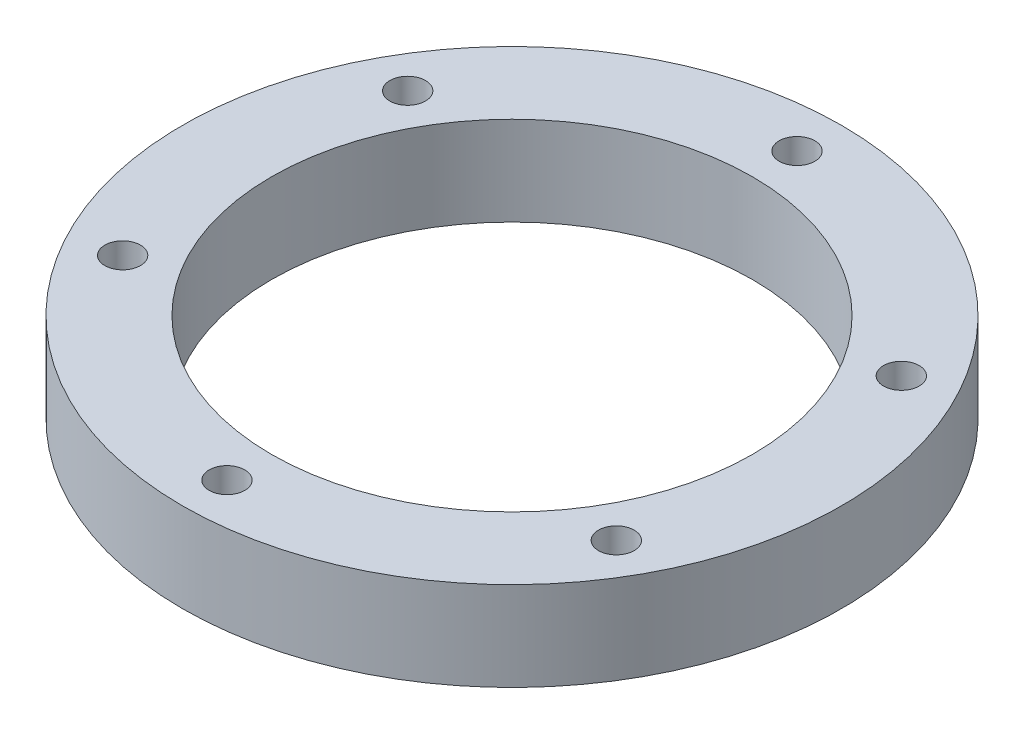
ISO-10303-21;
HEADER;
FILE_DESCRIPTION(('STEP AP214'),'2;1');
FILE_NAME('part.step','',(''),(''),'','','');
FILE_SCHEMA(('AUTOMOTIVE_DESIGN { 1 0 10303 214 1 1 1 1 }'));
ENDSEC;
DATA;
#1=APPLICATION_CONTEXT('core data for automotive mechanical design processes');
#2=APPLICATION_PROTOCOL_DEFINITION('international standard','automotive_design',2000,#1);
#3=PRODUCT_CONTEXT('',#1,'mechanical');
#4=PRODUCT('Part','Part','',(#3));
#5=PRODUCT_RELATED_PRODUCT_CATEGORY('part','',(#4));
#6=PRODUCT_DEFINITION_FORMATION('','',#4);
#7=PRODUCT_DEFINITION_CONTEXT('part definition',#1,'design');
#8=PRODUCT_DEFINITION('design','',#6,#7);
#9=PRODUCT_DEFINITION_SHAPE('','',#8);
#10=(LENGTH_UNIT() NAMED_UNIT(*) SI_UNIT(.MILLI.,.METRE.));
#11=(NAMED_UNIT(*) PLANE_ANGLE_UNIT() SI_UNIT($,.RADIAN.));
#12=(NAMED_UNIT(*) SI_UNIT($,.STERADIAN.) SOLID_ANGLE_UNIT());
#13=UNCERTAINTY_MEASURE_WITH_UNIT(LENGTH_MEASURE(1.E-05),#10,'distance_accuracy_value','');
#14=(GEOMETRIC_REPRESENTATION_CONTEXT(3) GLOBAL_UNCERTAINTY_ASSIGNED_CONTEXT((#13)) GLOBAL_UNIT_ASSIGNED_CONTEXT((#10,
#11,#12)) REPRESENTATION_CONTEXT('',''));
#15=CARTESIAN_POINT('',(0.,0.,0.));
#16=DIRECTION('',(0.,0.,1.));
#17=DIRECTION('',(1.,0.,0.));
#18=AXIS2_PLACEMENT_3D('',#15,#16,#17);
#19=CARTESIAN_POINT('',(0.,0.,0.));
#20=DIRECTION('',(0.,1.,0.));
#21=DIRECTION('',(0.,0.,1.));
#22=AXIS2_PLACEMENT_3D('',#19,#20,#21);
#23=PLANE('',#22);
#24=CARTESIAN_POINT('',(0.,0.,-32.));
#25=DIRECTION('',(0.,1.,0.));
#26=DIRECTION('',(0.,0.,1.));
#27=AXIS2_PLACEMENT_3D('',#24,#25,#26);
#28=CIRCLE('',#27,2.);
#29=CARTESIAN_POINT('',(0.,0.,-30.));
#30=VERTEX_POINT('',#29);
#31=EDGE_CURVE('E66',#30,#30,#28,.T.);
#32=ORIENTED_EDGE('',*,*,#31,.T.);
#33=EDGE_LOOP('',(#32));
#34=FACE_BOUND('',#33,.T.);
#35=CARTESIAN_POINT('',(-27.7128129211019,0.,-16.0000000000003));
#36=DIRECTION('',(0.,1.,0.));
#37=DIRECTION('',(0.,0.,1.));
#38=AXIS2_PLACEMENT_3D('',#35,#36,#37);
#39=CIRCLE('',#38,2.);
#40=CARTESIAN_POINT('',(-27.7128129211019,0.,-14.0000000000003));
#41=VERTEX_POINT('',#40);
#42=EDGE_CURVE('E104',#41,#41,#39,.T.);
#43=ORIENTED_EDGE('',*,*,#42,.T.);
#44=EDGE_LOOP('',(#43));
#45=FACE_BOUND('',#44,.T.);
#46=CARTESIAN_POINT('',(-27.7128129211022,0.,15.9999999999997));
#47=DIRECTION('',(0.,1.,0.));
#48=DIRECTION('',(0.,0.,1.));
#49=AXIS2_PLACEMENT_3D('',#46,#47,#48);
#50=CIRCLE('',#49,2.);
#51=CARTESIAN_POINT('',(-27.7128129211022,0.,17.9999999999997));
#52=VERTEX_POINT('',#51);
#53=EDGE_CURVE('E70',#52,#52,#50,.T.);
#54=ORIENTED_EDGE('',*,*,#53,.T.);
#55=EDGE_LOOP('',(#54));
#56=FACE_BOUND('',#55,.T.);
#57=CARTESIAN_POINT('',(-2.23454805685961E-13,0.,32.));
#58=DIRECTION('',(0.,1.,0.));
#59=DIRECTION('',(0.,0.,1.));
#60=AXIS2_PLACEMENT_3D('',#57,#58,#59);
#61=CIRCLE('',#60,2.);
#62=CARTESIAN_POINT('',(-2.23454805685961E-13,0.,34.));
#63=VERTEX_POINT('',#62);
#64=EDGE_CURVE('E79',#63,#63,#61,.T.);
#65=ORIENTED_EDGE('',*,*,#64,.T.);
#66=EDGE_LOOP('',(#65));
#67=FACE_BOUND('',#66,.T.);
#68=CARTESIAN_POINT('',(27.712812921102,0.,16.0000000000001));
#69=DIRECTION('',(0.,1.,0.));
#70=DIRECTION('',(0.,0.,1.));
#71=AXIS2_PLACEMENT_3D('',#68,#69,#70);
#72=CIRCLE('',#71,2.);
#73=CARTESIAN_POINT('',(27.712812921102,0.,18.0000000000001));
#74=VERTEX_POINT('',#73);
#75=EDGE_CURVE('E87',#74,#74,#72,.T.);
#76=ORIENTED_EDGE('',*,*,#75,.T.);
#77=EDGE_LOOP('',(#76));
#78=FACE_BOUND('',#77,.T.);
#79=CARTESIAN_POINT('',(27.7128129211021,0.,-15.9999999999999));
#80=DIRECTION('',(0.,1.,0.));
#81=DIRECTION('',(0.,0.,1.));
#82=AXIS2_PLACEMENT_3D('',#79,#80,#81);
#83=CIRCLE('',#82,2.);
#84=CARTESIAN_POINT('',(27.7128129211021,0.,-13.9999999999999));
#85=VERTEX_POINT('',#84);
#86=EDGE_CURVE('E95',#85,#85,#83,.T.);
#87=ORIENTED_EDGE('',*,*,#86,.T.);
#88=EDGE_LOOP('',(#87));
#89=FACE_BOUND('',#88,.T.);
#90=CARTESIAN_POINT('',(0.,0.,0.));
#91=DIRECTION('',(0.,1.,0.));
#92=DIRECTION('',(0.,0.,1.));
#93=AXIS2_PLACEMENT_3D('',#90,#91,#92);
#94=CIRCLE('',#93,27.);
#95=CARTESIAN_POINT('',(0.,0.,27.));
#96=VERTEX_POINT('',#95);
#97=EDGE_CURVE('E11',#96,#96,#94,.T.);
#98=ORIENTED_EDGE('',*,*,#97,.T.);
#99=EDGE_LOOP('',(#98));
#100=FACE_BOUND('',#99,.T.);
#101=CARTESIAN_POINT('',(0.,0.,0.));
#102=DIRECTION('',(0.,1.,0.));
#103=DIRECTION('',(0.,0.,1.));
#104=AXIS2_PLACEMENT_3D('',#101,#102,#103);
#105=CIRCLE('',#104,37.);
#106=CARTESIAN_POINT('',(0.,0.,37.));
#107=VERTEX_POINT('',#106);
#108=EDGE_CURVE('E60',#107,#107,#105,.T.);
#109=ORIENTED_EDGE('',*,*,#108,.F.);
#110=EDGE_LOOP('',(#109));
#111=FACE_BOUND('',#110,.T.);
#112=ADVANCED_FACE('F48',(#34,#45,#56,#67,#78,#89,#100,#111),#23,.F.);
#113=CARTESIAN_POINT('',(0.,0.,0.));
#114=DIRECTION('',(0.,1.,0.));
#115=DIRECTION('',(0.,0.,1.));
#116=AXIS2_PLACEMENT_3D('',#113,#114,#115);
#117=CYLINDRICAL_SURFACE('',#116,27.);
#118=ORIENTED_EDGE('',*,*,#97,.F.);
#119=EDGE_LOOP('',(#118));
#120=FACE_BOUND('',#119,.T.);
#121=CARTESIAN_POINT('',(0.,10.,0.));
#122=DIRECTION('',(0.,1.,0.));
#123=DIRECTION('',(0.,0.,1.));
#124=AXIS2_PLACEMENT_3D('',#121,#122,#123);
#125=CIRCLE('',#124,27.);
#126=CARTESIAN_POINT('',(0.,10.,27.));
#127=VERTEX_POINT('',#126);
#128=EDGE_CURVE('E51',#127,#127,#125,.T.);
#129=ORIENTED_EDGE('',*,*,#128,.T.);
#130=EDGE_LOOP('',(#129));
#131=FACE_BOUND('',#130,.T.);
#132=ADVANCED_FACE('F147',(#120,#131),#117,.F.);
#133=CARTESIAN_POINT('',(0.,0.,0.));
#134=DIRECTION('',(0.,1.,0.));
#135=DIRECTION('',(0.,0.,1.));
#136=AXIS2_PLACEMENT_3D('',#133,#134,#135);
#137=CYLINDRICAL_SURFACE('',#136,37.);
#138=ORIENTED_EDGE('',*,*,#108,.T.);
#139=EDGE_LOOP('',(#138));
#140=FACE_BOUND('',#139,.T.);
#141=CARTESIAN_POINT('',(0.,10.,0.));
#142=DIRECTION('',(0.,1.,0.));
#143=DIRECTION('',(0.,0.,1.));
#144=AXIS2_PLACEMENT_3D('',#141,#142,#143);
#145=CIRCLE('',#144,37.);
#146=CARTESIAN_POINT('',(0.,10.,37.));
#147=VERTEX_POINT('',#146);
#148=EDGE_CURVE('E62',#147,#147,#145,.T.);
#149=ORIENTED_EDGE('',*,*,#148,.F.);
#150=EDGE_LOOP('',(#149));
#151=FACE_BOUND('',#150,.T.);
#152=ADVANCED_FACE('F131',(#140,#151),#137,.T.);
#153=CARTESIAN_POINT('',(0.,10.,0.));
#154=DIRECTION('',(0.,1.,0.));
#155=DIRECTION('',(0.,0.,1.));
#156=AXIS2_PLACEMENT_3D('',#153,#154,#155);
#157=PLANE('',#156);
#158=CARTESIAN_POINT('',(0.,10.,-32.));
#159=DIRECTION('',(0.,1.,0.));
#160=DIRECTION('',(0.,0.,1.));
#161=AXIS2_PLACEMENT_3D('',#158,#159,#160);
#162=CIRCLE('',#161,2.);
#163=CARTESIAN_POINT('',(0.,10.,-30.));
#164=VERTEX_POINT('',#163);
#165=EDGE_CURVE('E103',#164,#164,#162,.T.);
#166=ORIENTED_EDGE('',*,*,#165,.F.);
#167=EDGE_LOOP('',(#166));
#168=FACE_BOUND('',#167,.T.);
#169=CARTESIAN_POINT('',(-27.7128129211019,10.,-16.0000000000003));
#170=DIRECTION('',(0.,1.,0.));
#171=DIRECTION('',(0.,0.,1.));
#172=AXIS2_PLACEMENT_3D('',#169,#170,#171);
#173=CIRCLE('',#172,2.);
#174=CARTESIAN_POINT('',(-27.7128129211019,10.,-14.0000000000003));
#175=VERTEX_POINT('',#174);
#176=EDGE_CURVE('E75',#175,#175,#173,.T.);
#177=ORIENTED_EDGE('',*,*,#176,.F.);
#178=EDGE_LOOP('',(#177));
#179=FACE_BOUND('',#178,.T.);
#180=CARTESIAN_POINT('',(-27.7128129211022,10.,15.9999999999997));
#181=DIRECTION('',(0.,1.,0.));
#182=DIRECTION('',(0.,0.,1.));
#183=AXIS2_PLACEMENT_3D('',#180,#181,#182);
#184=CIRCLE('',#183,2.);
#185=CARTESIAN_POINT('',(-27.7128129211022,10.,17.9999999999997));
#186=VERTEX_POINT('',#185);
#187=EDGE_CURVE('E74',#186,#186,#184,.T.);
#188=ORIENTED_EDGE('',*,*,#187,.F.);
#189=EDGE_LOOP('',(#188));
#190=FACE_BOUND('',#189,.T.);
#191=CARTESIAN_POINT('',(-2.23454805685961E-13,10.,32.));
#192=DIRECTION('',(0.,1.,0.));
#193=DIRECTION('',(0.,0.,1.));
#194=AXIS2_PLACEMENT_3D('',#191,#192,#193);
#195=CIRCLE('',#194,2.);
#196=CARTESIAN_POINT('',(-2.23454805685961E-13,10.,34.));
#197=VERTEX_POINT('',#196);
#198=EDGE_CURVE('E83',#197,#197,#195,.T.);
#199=ORIENTED_EDGE('',*,*,#198,.F.);
#200=EDGE_LOOP('',(#199));
#201=FACE_BOUND('',#200,.T.);
#202=CARTESIAN_POINT('',(27.712812921102,10.,16.0000000000001));
#203=DIRECTION('',(0.,1.,0.));
#204=DIRECTION('',(0.,0.,1.));
#205=AXIS2_PLACEMENT_3D('',#202,#203,#204);
#206=CIRCLE('',#205,2.);
#207=CARTESIAN_POINT('',(27.712812921102,10.,18.0000000000001));
#208=VERTEX_POINT('',#207);
#209=EDGE_CURVE('E91',#208,#208,#206,.T.);
#210=ORIENTED_EDGE('',*,*,#209,.F.);
#211=EDGE_LOOP('',(#210));
#212=FACE_BOUND('',#211,.T.);
#213=CARTESIAN_POINT('',(27.7128129211021,10.,-15.9999999999999));
#214=DIRECTION('',(0.,1.,0.));
#215=DIRECTION('',(0.,0.,1.));
#216=AXIS2_PLACEMENT_3D('',#213,#214,#215);
#217=CIRCLE('',#216,2.);
#218=CARTESIAN_POINT('',(27.7128129211021,10.,-13.9999999999999));
#219=VERTEX_POINT('',#218);
#220=EDGE_CURVE('E99',#219,#219,#217,.T.);
#221=ORIENTED_EDGE('',*,*,#220,.F.);
#222=EDGE_LOOP('',(#221));
#223=FACE_BOUND('',#222,.T.);
#224=ORIENTED_EDGE('',*,*,#128,.F.);
#225=EDGE_LOOP('',(#224));
#226=FACE_BOUND('',#225,.T.);
#227=ORIENTED_EDGE('',*,*,#148,.T.);
#228=EDGE_LOOP('',(#227));
#229=FACE_BOUND('',#228,.T.);
#230=ADVANCED_FACE('F127',(#168,#179,#190,#201,#212,#223,#226,#229),#157,.T.);
#231=CARTESIAN_POINT('',(27.7128129211021,0.,-15.9999999999999));
#232=DIRECTION('',(0.,1.,0.));
#233=DIRECTION('',(0.,0.,1.));
#234=AXIS2_PLACEMENT_3D('',#231,#232,#233);
#235=CYLINDRICAL_SURFACE('',#234,2.);
#236=ORIENTED_EDGE('',*,*,#86,.F.);
#237=EDGE_LOOP('',(#236));
#238=FACE_BOUND('',#237,.T.);
#239=ORIENTED_EDGE('',*,*,#220,.T.);
#240=EDGE_LOOP('',(#239));
#241=FACE_BOUND('',#240,.T.);
#242=ADVANCED_FACE('F130',(#238,#241),#235,.F.);
#243=CARTESIAN_POINT('',(27.712812921102,0.,16.0000000000001));
#244=DIRECTION('',(0.,1.,0.));
#245=DIRECTION('',(0.,0.,1.));
#246=AXIS2_PLACEMENT_3D('',#243,#244,#245);
#247=CYLINDRICAL_SURFACE('',#246,2.);
#248=ORIENTED_EDGE('',*,*,#75,.F.);
#249=EDGE_LOOP('',(#248));
#250=FACE_BOUND('',#249,.T.);
#251=ORIENTED_EDGE('',*,*,#209,.T.);
#252=EDGE_LOOP('',(#251));
#253=FACE_BOUND('',#252,.T.);
#254=ADVANCED_FACE('F170',(#250,#253),#247,.F.);
#255=CARTESIAN_POINT('',(-2.23454805685961E-13,0.,32.));
#256=DIRECTION('',(0.,1.,0.));
#257=DIRECTION('',(0.,0.,1.));
#258=AXIS2_PLACEMENT_3D('',#255,#256,#257);
#259=CYLINDRICAL_SURFACE('',#258,2.);
#260=ORIENTED_EDGE('',*,*,#64,.F.);
#261=EDGE_LOOP('',(#260));
#262=FACE_BOUND('',#261,.T.);
#263=ORIENTED_EDGE('',*,*,#198,.T.);
#264=EDGE_LOOP('',(#263));
#265=FACE_BOUND('',#264,.T.);
#266=ADVANCED_FACE('F179',(#262,#265),#259,.F.);
#267=CARTESIAN_POINT('',(-27.7128129211022,0.,15.9999999999997));
#268=DIRECTION('',(0.,1.,0.));
#269=DIRECTION('',(0.,0.,1.));
#270=AXIS2_PLACEMENT_3D('',#267,#268,#269);
#271=CYLINDRICAL_SURFACE('',#270,2.);
#272=ORIENTED_EDGE('',*,*,#53,.F.);
#273=EDGE_LOOP('',(#272));
#274=FACE_BOUND('',#273,.T.);
#275=ORIENTED_EDGE('',*,*,#187,.T.);
#276=EDGE_LOOP('',(#275));
#277=FACE_BOUND('',#276,.T.);
#278=ADVANCED_FACE('F188',(#274,#277),#271,.F.);
#279=CARTESIAN_POINT('',(-27.7128129211019,0.,-16.0000000000003));
#280=DIRECTION('',(0.,1.,0.));
#281=DIRECTION('',(0.,0.,1.));
#282=AXIS2_PLACEMENT_3D('',#279,#280,#281);
#283=CYLINDRICAL_SURFACE('',#282,2.);
#284=ORIENTED_EDGE('',*,*,#42,.F.);
#285=EDGE_LOOP('',(#284));
#286=FACE_BOUND('',#285,.T.);
#287=ORIENTED_EDGE('',*,*,#176,.T.);
#288=EDGE_LOOP('',(#287));
#289=FACE_BOUND('',#288,.T.);
#290=ADVANCED_FACE('F123',(#286,#289),#283,.F.);
#291=CARTESIAN_POINT('',(0.,0.,-32.));
#292=DIRECTION('',(0.,1.,0.));
#293=DIRECTION('',(0.,0.,1.));
#294=AXIS2_PLACEMENT_3D('',#291,#292,#293);
#295=CYLINDRICAL_SURFACE('',#294,2.);
#296=ORIENTED_EDGE('',*,*,#31,.F.);
#297=EDGE_LOOP('',(#296));
#298=FACE_BOUND('',#297,.T.);
#299=ORIENTED_EDGE('',*,*,#165,.T.);
#300=EDGE_LOOP('',(#299));
#301=FACE_BOUND('',#300,.T.);
#302=ADVANCED_FACE('F120',(#298,#301),#295,.F.);
#303=CLOSED_SHELL('',(#112,#132,#152,#230,#242,#254,#266,#278,#290,#302));
#304=MANIFOLD_SOLID_BREP('B2',#303);
#305=ADVANCED_BREP_SHAPE_REPRESENTATION('',(#18,#304),#14);
#306=SHAPE_DEFINITION_REPRESENTATION(#9,#305);
ENDSEC;
END-ISO-10303-21;
